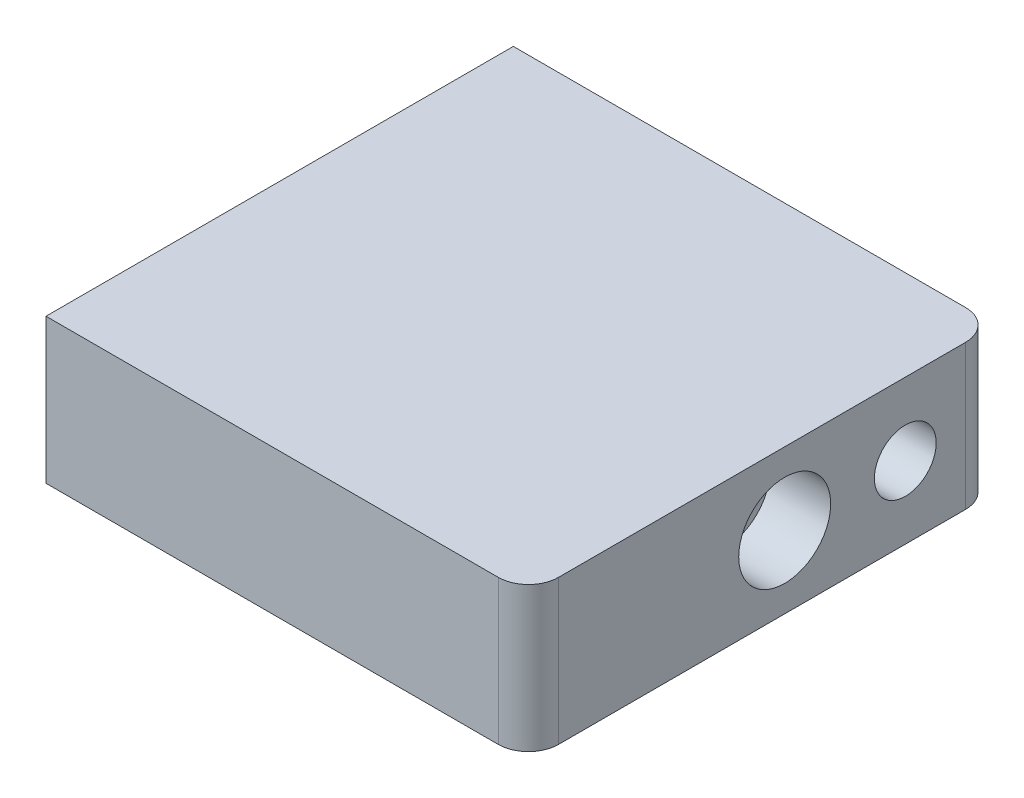
ISO-10303-21;
HEADER;
FILE_DESCRIPTION(('STEP AP214'),'2;1');
FILE_NAME('part.step','',(''),(''),'','','');
FILE_SCHEMA(('AUTOMOTIVE_DESIGN { 1 0 10303 214 1 1 1 1 }'));
ENDSEC;
DATA;
#1=APPLICATION_CONTEXT('core data for automotive mechanical design processes');
#2=APPLICATION_PROTOCOL_DEFINITION('international standard','automotive_design',2000,#1);
#3=PRODUCT_CONTEXT('',#1,'mechanical');
#4=PRODUCT('Part','Part','',(#3));
#5=PRODUCT_RELATED_PRODUCT_CATEGORY('part','',(#4));
#6=PRODUCT_DEFINITION_FORMATION('','',#4);
#7=PRODUCT_DEFINITION_CONTEXT('part definition',#1,'design');
#8=PRODUCT_DEFINITION('design','',#6,#7);
#9=PRODUCT_DEFINITION_SHAPE('','',#8);
#10=(LENGTH_UNIT() NAMED_UNIT(*) SI_UNIT(.MILLI.,.METRE.));
#11=(NAMED_UNIT(*) PLANE_ANGLE_UNIT() SI_UNIT($,.RADIAN.));
#12=(NAMED_UNIT(*) SI_UNIT($,.STERADIAN.) SOLID_ANGLE_UNIT());
#13=UNCERTAINTY_MEASURE_WITH_UNIT(LENGTH_MEASURE(1.E-05),#10,'distance_accuracy_value','');
#14=(GEOMETRIC_REPRESENTATION_CONTEXT(3) GLOBAL_UNCERTAINTY_ASSIGNED_CONTEXT((#13)) GLOBAL_UNIT_ASSIGNED_CONTEXT((#10,
#11,#12)) REPRESENTATION_CONTEXT('',''));
#15=CARTESIAN_POINT('',(0.,0.,0.));
#16=DIRECTION('',(0.,0.,1.));
#17=DIRECTION('',(1.,0.,0.));
#18=AXIS2_PLACEMENT_3D('',#15,#16,#17);
#19=CARTESIAN_POINT('',(80.,24.,0.));
#20=DIRECTION('',(0.,0.,-1.));
#21=DIRECTION('',(-1.,0.,0.));
#22=AXIS2_PLACEMENT_3D('',#19,#20,#21);
#23=PLANE('',#22);
#24=DIRECTION('',(1.,0.,0.));
#25=VECTOR('',#24,1.);
#26=CARTESIAN_POINT('',(80.,0.,0.));
#27=LINE('',#26,#25);
#28=CARTESIAN_POINT('',(0.,0.,0.));
#29=VERTEX_POINT('',#28);
#30=CARTESIAN_POINT('',(75.,0.,0.));
#31=VERTEX_POINT('',#30);
#32=EDGE_CURVE('E111',#29,#31,#27,.T.);
#33=ORIENTED_EDGE('',*,*,#32,.T.);
#34=DIRECTION('',(0.,-1.,0.));
#35=VECTOR('',#34,1.);
#36=CARTESIAN_POINT('',(75.,24.,0.));
#37=LINE('',#36,#35);
#38=CARTESIAN_POINT('',(75.,24.,0.));
#39=VERTEX_POINT('',#38);
#40=EDGE_CURVE('E55',#31,#39,#37,.F.);
#41=ORIENTED_EDGE('',*,*,#40,.T.);
#42=DIRECTION('',(1.,0.,0.));
#43=VECTOR('',#42,1.);
#44=CARTESIAN_POINT('',(80.,24.,0.));
#45=LINE('',#44,#43);
#46=CARTESIAN_POINT('',(0.,24.,0.));
#47=VERTEX_POINT('',#46);
#48=EDGE_CURVE('E119',#47,#39,#45,.T.);
#49=ORIENTED_EDGE('',*,*,#48,.F.);
#50=DIRECTION('',(0.,-1.,0.));
#51=VECTOR('',#50,1.);
#52=CARTESIAN_POINT('',(0.,24.,0.));
#53=LINE('',#52,#51);
#54=EDGE_CURVE('E103',#47,#29,#53,.T.);
#55=ORIENTED_EDGE('',*,*,#54,.T.);
#56=EDGE_LOOP('',(#33,#41,#49,#55));
#57=FACE_BOUND('',#56,.T.);
#58=ADVANCED_FACE('F32',(#57),#23,.F.);
#59=CARTESIAN_POINT('',(80.,24.,-77.5));
#60=DIRECTION('',(-1.,0.,0.));
#61=DIRECTION('',(0.,0.,1.));
#62=AXIS2_PLACEMENT_3D('',#59,#60,#61);
#63=PLANE('',#62);
#64=CARTESIAN_POINT('',(80.,12.,-62.5));
#65=DIRECTION('',(-1.,0.,0.));
#66=DIRECTION('',(0.,0.,1.));
#67=AXIS2_PLACEMENT_3D('',#64,#65,#66);
#68=CIRCLE('',#67,5.125);
#69=CARTESIAN_POINT('',(80.,12.,-57.375));
#70=VERTEX_POINT('',#69);
#71=EDGE_CURVE('E150',#70,#70,#68,.T.);
#72=ORIENTED_EDGE('',*,*,#71,.T.);
#73=EDGE_LOOP('',(#72));
#74=FACE_BOUND('',#73,.T.);
#75=CARTESIAN_POINT('',(80.,12.,-42.5));
#76=DIRECTION('',(-1.,0.,0.));
#77=DIRECTION('',(0.,0.,1.));
#78=AXIS2_PLACEMENT_3D('',#75,#76,#77);
#79=CIRCLE('',#78,7.625);
#80=CARTESIAN_POINT('',(80.,12.,-34.875));
#81=VERTEX_POINT('',#80);
#82=EDGE_CURVE('E144',#81,#81,#79,.T.);
#83=ORIENTED_EDGE('',*,*,#82,.T.);
#84=EDGE_LOOP('',(#83));
#85=FACE_BOUND('',#84,.T.);
#86=DIRECTION('',(0.,0.,-1.));
#87=VECTOR('',#86,1.);
#88=CARTESIAN_POINT('',(80.,24.,-77.5));
#89=LINE('',#88,#87);
#90=CARTESIAN_POINT('',(80.,24.,-5.));
#91=VERTEX_POINT('',#90);
#92=CARTESIAN_POINT('',(80.,24.,-72.5));
#93=VERTEX_POINT('',#92);
#94=EDGE_CURVE('E93',#91,#93,#89,.T.);
#95=ORIENTED_EDGE('',*,*,#94,.F.);
#96=DIRECTION('',(0.,-1.,0.));
#97=VECTOR('',#96,1.);
#98=CARTESIAN_POINT('',(80.,24.,-5.));
#99=LINE('',#98,#97);
#100=CARTESIAN_POINT('',(80.,0.,-5.));
#101=VERTEX_POINT('',#100);
#102=EDGE_CURVE('E122',#91,#101,#99,.T.);
#103=ORIENTED_EDGE('',*,*,#102,.T.);
#104=DIRECTION('',(0.,0.,-1.));
#105=VECTOR('',#104,1.);
#106=CARTESIAN_POINT('',(80.,0.,-77.5));
#107=LINE('',#106,#105);
#108=CARTESIAN_POINT('',(80.,0.,-72.5));
#109=VERTEX_POINT('',#108);
#110=EDGE_CURVE('E113',#101,#109,#107,.T.);
#111=ORIENTED_EDGE('',*,*,#110,.T.);
#112=DIRECTION('',(0.,-1.,0.));
#113=VECTOR('',#112,1.);
#114=CARTESIAN_POINT('',(80.,24.,-72.5));
#115=LINE('',#114,#113);
#116=EDGE_CURVE('E102',#109,#93,#115,.F.);
#117=ORIENTED_EDGE('',*,*,#116,.T.);
#118=EDGE_LOOP('',(#95,#103,#111,#117));
#119=FACE_BOUND('',#118,.T.);
#120=ADVANCED_FACE('F135',(#74,#85,#119),#63,.F.);
#121=CARTESIAN_POINT('',(0.,24.,-77.5));
#122=DIRECTION('',(0.,0.,1.));
#123=DIRECTION('',(1.,0.,0.));
#124=AXIS2_PLACEMENT_3D('',#121,#122,#123);
#125=PLANE('',#124);
#126=DIRECTION('',(-1.,0.,0.));
#127=VECTOR('',#126,1.);
#128=CARTESIAN_POINT('',(0.,24.,-77.5));
#129=LINE('',#128,#127);
#130=CARTESIAN_POINT('',(75.,24.,-77.5));
#131=VERTEX_POINT('',#130);
#132=CARTESIAN_POINT('',(0.,24.,-77.5));
#133=VERTEX_POINT('',#132);
#134=EDGE_CURVE('E85',#131,#133,#129,.T.);
#135=ORIENTED_EDGE('',*,*,#134,.F.);
#136=DIRECTION('',(0.,-1.,0.));
#137=VECTOR('',#136,1.);
#138=CARTESIAN_POINT('',(75.,24.,-77.5));
#139=LINE('',#138,#137);
#140=CARTESIAN_POINT('',(75.,0.,-77.5));
#141=VERTEX_POINT('',#140);
#142=EDGE_CURVE('E11',#131,#141,#139,.T.);
#143=ORIENTED_EDGE('',*,*,#142,.T.);
#144=DIRECTION('',(-1.,0.,0.));
#145=VECTOR('',#144,1.);
#146=CARTESIAN_POINT('',(0.,0.,-77.5));
#147=LINE('',#146,#145);
#148=CARTESIAN_POINT('',(0.,0.,-77.5));
#149=VERTEX_POINT('',#148);
#150=EDGE_CURVE('E99',#141,#149,#147,.T.);
#151=ORIENTED_EDGE('',*,*,#150,.T.);
#152=DIRECTION('',(0.,-1.,0.));
#153=VECTOR('',#152,1.);
#154=CARTESIAN_POINT('',(0.,24.,-77.5));
#155=LINE('',#154,#153);
#156=EDGE_CURVE('E96',#133,#149,#155,.T.);
#157=ORIENTED_EDGE('',*,*,#156,.F.);
#158=EDGE_LOOP('',(#135,#143,#151,#157));
#159=FACE_BOUND('',#158,.T.);
#160=ADVANCED_FACE('F97',(#159),#125,.F.);
#161=CARTESIAN_POINT('',(0.,24.,0.));
#162=DIRECTION('',(1.,0.,0.));
#163=DIRECTION('',(0.,0.,-1.));
#164=AXIS2_PLACEMENT_3D('',#161,#162,#163);
#165=PLANE('',#164);
#166=DIRECTION('',(0.,0.,1.));
#167=VECTOR('',#166,1.);
#168=CARTESIAN_POINT('',(0.,0.,0.));
#169=LINE('',#168,#167);
#170=EDGE_CURVE('E118',#149,#29,#169,.T.);
#171=ORIENTED_EDGE('',*,*,#170,.T.);
#172=ORIENTED_EDGE('',*,*,#54,.F.);
#173=DIRECTION('',(0.,0.,1.));
#174=VECTOR('',#173,1.);
#175=CARTESIAN_POINT('',(0.,24.,0.));
#176=LINE('',#175,#174);
#177=EDGE_CURVE('E89',#133,#47,#176,.T.);
#178=ORIENTED_EDGE('',*,*,#177,.F.);
#179=ORIENTED_EDGE('',*,*,#156,.T.);
#180=EDGE_LOOP('',(#171,#172,#178,#179));
#181=FACE_BOUND('',#180,.T.);
#182=ADVANCED_FACE('F105',(#181),#165,.F.);
#183=CARTESIAN_POINT('',(0.,24.,0.));
#184=DIRECTION('',(0.,-1.,0.));
#185=DIRECTION('',(0.,0.,-1.));
#186=AXIS2_PLACEMENT_3D('',#183,#184,#185);
#187=PLANE('',#186);
#188=ORIENTED_EDGE('',*,*,#48,.T.);
#189=CARTESIAN_POINT('',(75.,24.,-5.));
#190=DIRECTION('',(0.,-1.,0.));
#191=DIRECTION('',(0.,0.,-1.));
#192=AXIS2_PLACEMENT_3D('',#189,#190,#191);
#193=CIRCLE('',#192,5.);
#194=EDGE_CURVE('E40',#39,#91,#193,.F.);
#195=ORIENTED_EDGE('',*,*,#194,.T.);
#196=ORIENTED_EDGE('',*,*,#94,.T.);
#197=CARTESIAN_POINT('',(75.,24.,-72.5));
#198=DIRECTION('',(0.,-1.,0.));
#199=DIRECTION('',(0.,0.,-1.));
#200=AXIS2_PLACEMENT_3D('',#197,#198,#199);
#201=CIRCLE('',#200,5.);
#202=EDGE_CURVE('E47',#93,#131,#201,.F.);
#203=ORIENTED_EDGE('',*,*,#202,.T.);
#204=ORIENTED_EDGE('',*,*,#134,.T.);
#205=ORIENTED_EDGE('',*,*,#177,.T.);
#206=EDGE_LOOP('',(#188,#195,#196,#203,#204,#205));
#207=FACE_BOUND('',#206,.T.);
#208=ADVANCED_FACE('F87',(#207),#187,.F.);
#209=CARTESIAN_POINT('',(0.,0.,0.));
#210=DIRECTION('',(0.,-1.,0.));
#211=DIRECTION('',(0.,0.,-1.));
#212=AXIS2_PLACEMENT_3D('',#209,#210,#211);
#213=PLANE('',#212);
#214=ORIENTED_EDGE('',*,*,#110,.F.);
#215=CARTESIAN_POINT('',(75.,0.,-5.));
#216=DIRECTION('',(0.,-1.,0.));
#217=DIRECTION('',(0.,0.,-1.));
#218=AXIS2_PLACEMENT_3D('',#215,#216,#217);
#219=CIRCLE('',#218,5.);
#220=EDGE_CURVE('E127',#101,#31,#219,.T.);
#221=ORIENTED_EDGE('',*,*,#220,.T.);
#222=ORIENTED_EDGE('',*,*,#32,.F.);
#223=ORIENTED_EDGE('',*,*,#170,.F.);
#224=ORIENTED_EDGE('',*,*,#150,.F.);
#225=CARTESIAN_POINT('',(75.,0.,-72.5));
#226=DIRECTION('',(0.,-1.,0.));
#227=DIRECTION('',(0.,0.,-1.));
#228=AXIS2_PLACEMENT_3D('',#225,#226,#227);
#229=CIRCLE('',#228,5.);
#230=EDGE_CURVE('E125',#141,#109,#229,.T.);
#231=ORIENTED_EDGE('',*,*,#230,.T.);
#232=EDGE_LOOP('',(#214,#221,#222,#223,#224,#231));
#233=FACE_BOUND('',#232,.T.);
#234=ADVANCED_FACE('F141',(#233),#213,.T.);
#235=CARTESIAN_POINT('',(70.,12.,-42.5));
#236=DIRECTION('',(1.,0.,0.));
#237=DIRECTION('',(0.,0.,-1.));
#238=AXIS2_PLACEMENT_3D('',#235,#236,#237);
#239=CYLINDRICAL_SURFACE('',#238,7.625);
#240=CARTESIAN_POINT('',(70.,12.,-42.5));
#241=DIRECTION('',(-1.,0.,0.));
#242=DIRECTION('',(0.,0.,1.));
#243=AXIS2_PLACEMENT_3D('',#240,#241,#242);
#244=CIRCLE('',#243,7.625);
#245=CARTESIAN_POINT('',(70.,12.,-34.875));
#246=VERTEX_POINT('',#245);
#247=EDGE_CURVE('E147',#246,#246,#244,.T.);
#248=ORIENTED_EDGE('',*,*,#247,.T.);
#249=EDGE_LOOP('',(#248));
#250=FACE_BOUND('',#249,.T.);
#251=ORIENTED_EDGE('',*,*,#82,.F.);
#252=EDGE_LOOP('',(#251));
#253=FACE_BOUND('',#252,.T.);
#254=ADVANCED_FACE('F182',(#250,#253),#239,.F.);
#255=CARTESIAN_POINT('',(70.,12.,-42.5));
#256=DIRECTION('',(-1.,0.,0.));
#257=DIRECTION('',(0.,0.,1.));
#258=AXIS2_PLACEMENT_3D('',#255,#256,#257);
#259=PLANE('',#258);
#260=ORIENTED_EDGE('',*,*,#247,.F.);
#261=EDGE_LOOP('',(#260));
#262=FACE_BOUND('',#261,.T.);
#263=ADVANCED_FACE('F166',(#262),#259,.F.);
#264=CARTESIAN_POINT('',(70.,12.,-62.5));
#265=DIRECTION('',(1.,0.,0.));
#266=DIRECTION('',(0.,0.,-1.));
#267=AXIS2_PLACEMENT_3D('',#264,#265,#266);
#268=CYLINDRICAL_SURFACE('',#267,5.125);
#269=CARTESIAN_POINT('',(70.,12.,-62.5));
#270=DIRECTION('',(-1.,0.,0.));
#271=DIRECTION('',(0.,0.,1.));
#272=AXIS2_PLACEMENT_3D('',#269,#270,#271);
#273=CIRCLE('',#272,5.125);
#274=CARTESIAN_POINT('',(70.,12.,-57.375));
#275=VERTEX_POINT('',#274);
#276=EDGE_CURVE('E114',#275,#275,#273,.T.);
#277=ORIENTED_EDGE('',*,*,#276,.T.);
#278=EDGE_LOOP('',(#277));
#279=FACE_BOUND('',#278,.T.);
#280=ORIENTED_EDGE('',*,*,#71,.F.);
#281=EDGE_LOOP('',(#280));
#282=FACE_BOUND('',#281,.T.);
#283=ADVANCED_FACE('F156',(#279,#282),#268,.F.);
#284=CARTESIAN_POINT('',(70.,12.,-62.5));
#285=DIRECTION('',(-1.,0.,0.));
#286=DIRECTION('',(0.,0.,1.));
#287=AXIS2_PLACEMENT_3D('',#284,#285,#286);
#288=PLANE('',#287);
#289=ORIENTED_EDGE('',*,*,#276,.F.);
#290=EDGE_LOOP('',(#289));
#291=FACE_BOUND('',#290,.T.);
#292=ADVANCED_FACE('F159',(#291),#288,.F.);
#293=CARTESIAN_POINT('',(75.,24.,-5.));
#294=DIRECTION('',(0.,-1.,0.));
#295=DIRECTION('',(0.,0.,-1.));
#296=AXIS2_PLACEMENT_3D('',#293,#294,#295);
#297=CYLINDRICAL_SURFACE('',#296,5.);
#298=ORIENTED_EDGE('',*,*,#194,.F.);
#299=ORIENTED_EDGE('',*,*,#40,.F.);
#300=ORIENTED_EDGE('',*,*,#220,.F.);
#301=ORIENTED_EDGE('',*,*,#102,.F.);
#302=EDGE_LOOP('',(#298,#299,#300,#301));
#303=FACE_BOUND('',#302,.T.);
#304=ADVANCED_FACE('F138',(#303),#297,.T.);
#305=CARTESIAN_POINT('',(75.,24.,-72.5));
#306=DIRECTION('',(0.,-1.,0.));
#307=DIRECTION('',(0.,0.,-1.));
#308=AXIS2_PLACEMENT_3D('',#305,#306,#307);
#309=CYLINDRICAL_SURFACE('',#308,5.);
#310=ORIENTED_EDGE('',*,*,#202,.F.);
#311=ORIENTED_EDGE('',*,*,#116,.F.);
#312=ORIENTED_EDGE('',*,*,#230,.F.);
#313=ORIENTED_EDGE('',*,*,#142,.F.);
#314=EDGE_LOOP('',(#310,#311,#312,#313));
#315=FACE_BOUND('',#314,.T.);
#316=ADVANCED_FACE('F34',(#315),#309,.T.);
#317=CLOSED_SHELL('',(#58,#120,#160,#182,#208,#234,#254,#263,#283,#292,#304,#316));
#318=MANIFOLD_SOLID_BREP('B2',#317);
#319=ADVANCED_BREP_SHAPE_REPRESENTATION('',(#18,#318),#14);
#320=SHAPE_DEFINITION_REPRESENTATION(#9,#319);
ENDSEC;
END-ISO-10303-21;
